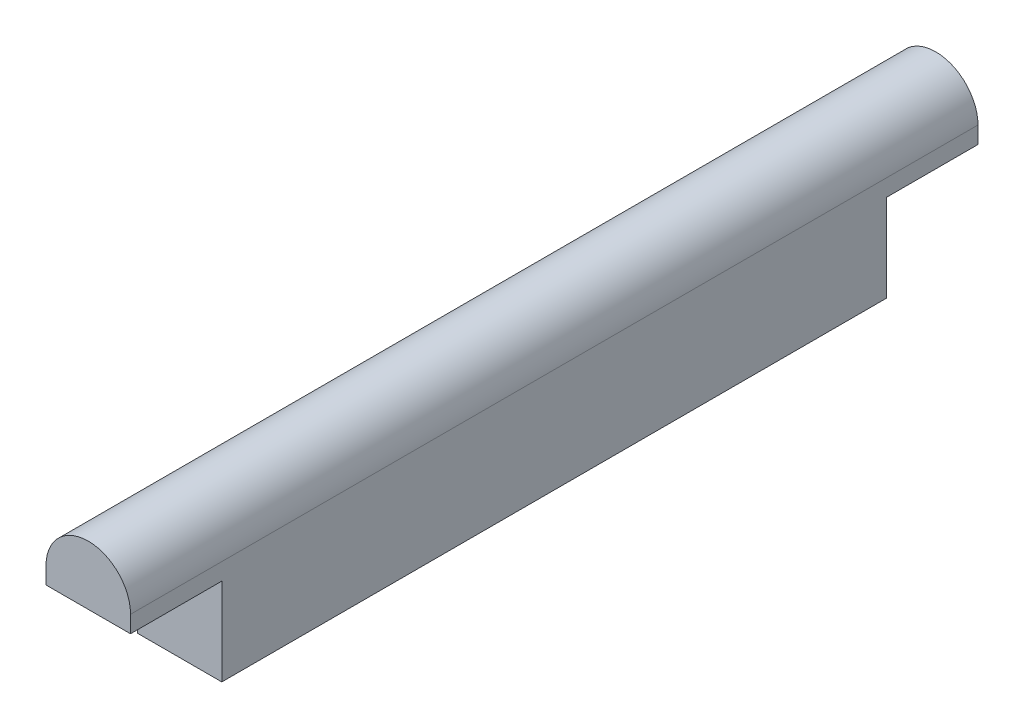
ISO-10303-21;
HEADER;
FILE_DESCRIPTION(('STEP AP214'),'2;1');
FILE_NAME('part.step','',(''),(''),'','','');
FILE_SCHEMA(('AUTOMOTIVE_DESIGN { 1 0 10303 214 1 1 1 1 }'));
ENDSEC;
DATA;
#1=APPLICATION_CONTEXT('core data for automotive mechanical design processes');
#2=APPLICATION_PROTOCOL_DEFINITION('international standard','automotive_design',2000,#1);
#3=PRODUCT_CONTEXT('',#1,'mechanical');
#4=PRODUCT('Part','Part','',(#3));
#5=PRODUCT_RELATED_PRODUCT_CATEGORY('part','',(#4));
#6=PRODUCT_DEFINITION_FORMATION('','',#4);
#7=PRODUCT_DEFINITION_CONTEXT('part definition',#1,'design');
#8=PRODUCT_DEFINITION('design','',#6,#7);
#9=PRODUCT_DEFINITION_SHAPE('','',#8);
#10=(LENGTH_UNIT() NAMED_UNIT(*) SI_UNIT(.MILLI.,.METRE.));
#11=(NAMED_UNIT(*) PLANE_ANGLE_UNIT() SI_UNIT($,.RADIAN.));
#12=(NAMED_UNIT(*) SI_UNIT($,.STERADIAN.) SOLID_ANGLE_UNIT());
#13=UNCERTAINTY_MEASURE_WITH_UNIT(LENGTH_MEASURE(1.E-05),#10,'distance_accuracy_value','');
#14=(GEOMETRIC_REPRESENTATION_CONTEXT(3) GLOBAL_UNCERTAINTY_ASSIGNED_CONTEXT((#13)) GLOBAL_UNIT_ASSIGNED_CONTEXT((#10,
#11,#12)) REPRESENTATION_CONTEXT('',''));
#15=CARTESIAN_POINT('',(0.,0.,0.));
#16=DIRECTION('',(0.,0.,1.));
#17=DIRECTION('',(1.,0.,0.));
#18=AXIS2_PLACEMENT_3D('',#15,#16,#17);
#19=CARTESIAN_POINT('',(7.5,-7.75,118.));
#20=DIRECTION('',(-1.,0.,0.));
#21=DIRECTION('',(0.,0.,1.));
#22=AXIS2_PLACEMENT_3D('',#19,#20,#21);
#23=PLANE('',#22);
#24=DIRECTION('',(0.,1.,0.));
#25=VECTOR('',#24,1.);
#26=CARTESIAN_POINT('',(7.5,-7.75,0.));
#27=LINE('',#26,#25);
#28=CARTESIAN_POINT('',(7.5,-7.75,0.));
#29=VERTEX_POINT('',#28);
#30=CARTESIAN_POINT('',(7.5,7.75,0.));
#31=VERTEX_POINT('',#30);
#32=EDGE_CURVE('E135',#29,#31,#27,.T.);
#33=ORIENTED_EDGE('',*,*,#32,.T.);
#34=DIRECTION('',(0.,0.,1.));
#35=VECTOR('',#34,1.);
#36=CARTESIAN_POINT('',(7.5,7.75,-16.2));
#37=LINE('',#36,#35);
#38=CARTESIAN_POINT('',(7.5,7.75,-16.2));
#39=VERTEX_POINT('',#38);
#40=EDGE_CURVE('E158',#39,#31,#37,.T.);
#41=ORIENTED_EDGE('',*,*,#40,.F.);
#42=DIRECTION('',(0.,1.,0.));
#43=VECTOR('',#42,1.);
#44=CARTESIAN_POINT('',(7.5,7.75,-16.2));
#45=LINE('',#44,#43);
#46=CARTESIAN_POINT('',(7.5,10.75,-16.2));
#47=VERTEX_POINT('',#46);
#48=EDGE_CURVE('E211',#39,#47,#45,.T.);
#49=ORIENTED_EDGE('',*,*,#48,.T.);
#50=DIRECTION('',(0.,0.,1.));
#51=VECTOR('',#50,1.);
#52=CARTESIAN_POINT('',(7.5,10.75,-16.2));
#53=LINE('',#52,#51);
#54=CARTESIAN_POINT('',(7.5,10.75,134.2));
#55=VERTEX_POINT('',#54);
#56=EDGE_CURVE('E188',#47,#55,#53,.T.);
#57=ORIENTED_EDGE('',*,*,#56,.T.);
#58=DIRECTION('',(0.,1.,0.));
#59=VECTOR('',#58,1.);
#60=CARTESIAN_POINT('',(7.5,7.75,134.2));
#61=LINE('',#60,#59);
#62=CARTESIAN_POINT('',(7.5,7.75,134.2));
#63=VERTEX_POINT('',#62);
#64=EDGE_CURVE('E195',#63,#55,#61,.T.);
#65=ORIENTED_EDGE('',*,*,#64,.F.);
#66=CARTESIAN_POINT('',(7.5,7.75,118.));
#67=VERTEX_POINT('',#66);
#68=EDGE_CURVE('E218',#67,#63,#37,.T.);
#69=ORIENTED_EDGE('',*,*,#68,.F.);
#70=DIRECTION('',(0.,1.,0.));
#71=VECTOR('',#70,1.);
#72=CARTESIAN_POINT('',(7.5,-7.75,118.));
#73=LINE('',#72,#71);
#74=CARTESIAN_POINT('',(7.5,-7.75,118.));
#75=VERTEX_POINT('',#74);
#76=EDGE_CURVE('E124',#75,#67,#73,.T.);
#77=ORIENTED_EDGE('',*,*,#76,.F.);
#78=DIRECTION('',(0.,0.,-1.));
#79=VECTOR('',#78,1.);
#80=CARTESIAN_POINT('',(7.5,-7.75,118.));
#81=LINE('',#80,#79);
#82=EDGE_CURVE('E67',#75,#29,#81,.T.);
#83=ORIENTED_EDGE('',*,*,#82,.T.);
#84=EDGE_LOOP('',(#33,#41,#49,#57,#65,#69,#77,#83));
#85=FACE_BOUND('',#84,.T.);
#86=ADVANCED_FACE('F58',(#85),#23,.F.);
#87=CARTESIAN_POINT('',(-7.5,-7.75,118.));
#88=DIRECTION('',(1.,0.,0.));
#89=DIRECTION('',(0.,0.,-1.));
#90=AXIS2_PLACEMENT_3D('',#87,#88,#89);
#91=PLANE('',#90);
#92=DIRECTION('',(0.,-1.,0.));
#93=VECTOR('',#92,1.);
#94=CARTESIAN_POINT('',(-7.5,-7.75,0.));
#95=LINE('',#94,#93);
#96=CARTESIAN_POINT('',(-7.5,7.75,0.));
#97=VERTEX_POINT('',#96);
#98=CARTESIAN_POINT('',(-7.5,-7.75,0.));
#99=VERTEX_POINT('',#98);
#100=EDGE_CURVE('E87',#97,#99,#95,.T.);
#101=ORIENTED_EDGE('',*,*,#100,.T.);
#102=DIRECTION('',(0.,0.,-1.));
#103=VECTOR('',#102,1.);
#104=CARTESIAN_POINT('',(-7.5,-7.75,118.));
#105=LINE('',#104,#103);
#106=CARTESIAN_POINT('',(-7.5,-7.75,118.));
#107=VERTEX_POINT('',#106);
#108=EDGE_CURVE('E13',#107,#99,#105,.T.);
#109=ORIENTED_EDGE('',*,*,#108,.F.);
#110=DIRECTION('',(0.,-1.,0.));
#111=VECTOR('',#110,1.);
#112=CARTESIAN_POINT('',(-7.5,-7.75,118.));
#113=LINE('',#112,#111);
#114=CARTESIAN_POINT('',(-7.5,7.75,118.));
#115=VERTEX_POINT('',#114);
#116=EDGE_CURVE('E122',#115,#107,#113,.T.);
#117=ORIENTED_EDGE('',*,*,#116,.F.);
#118=DIRECTION('',(0.,0.,1.));
#119=VECTOR('',#118,1.);
#120=CARTESIAN_POINT('',(-7.5,7.75,-16.2));
#121=LINE('',#120,#119);
#122=CARTESIAN_POINT('',(-7.5,7.75,134.2));
#123=VERTEX_POINT('',#122);
#124=EDGE_CURVE('E105',#115,#123,#121,.T.);
#125=ORIENTED_EDGE('',*,*,#124,.T.);
#126=DIRECTION('',(0.,1.,0.));
#127=VECTOR('',#126,1.);
#128=CARTESIAN_POINT('',(-7.5,7.75,134.2));
#129=LINE('',#128,#127);
#130=CARTESIAN_POINT('',(-7.5,10.75,134.2));
#131=VERTEX_POINT('',#130);
#132=EDGE_CURVE('E193',#123,#131,#129,.T.);
#133=ORIENTED_EDGE('',*,*,#132,.T.);
#134=DIRECTION('',(0.,0.,1.));
#135=VECTOR('',#134,1.);
#136=CARTESIAN_POINT('',(-7.5,10.75,-16.2));
#137=LINE('',#136,#135);
#138=CARTESIAN_POINT('',(-7.5,10.75,-16.2));
#139=VERTEX_POINT('',#138);
#140=EDGE_CURVE('E139',#139,#131,#137,.T.);
#141=ORIENTED_EDGE('',*,*,#140,.F.);
#142=DIRECTION('',(0.,1.,0.));
#143=VECTOR('',#142,1.);
#144=CARTESIAN_POINT('',(-7.5,7.75,-16.2));
#145=LINE('',#144,#143);
#146=CARTESIAN_POINT('',(-7.5,7.75,-16.2));
#147=VERTEX_POINT('',#146);
#148=EDGE_CURVE('E206',#147,#139,#145,.T.);
#149=ORIENTED_EDGE('',*,*,#148,.F.);
#150=EDGE_CURVE('E118',#147,#97,#121,.T.);
#151=ORIENTED_EDGE('',*,*,#150,.T.);
#152=EDGE_LOOP('',(#101,#109,#117,#125,#133,#141,#149,#151));
#153=FACE_BOUND('',#152,.T.);
#154=ADVANCED_FACE('F127',(#153),#91,.F.);
#155=CARTESIAN_POINT('',(-7.5,-7.75,118.));
#156=DIRECTION('',(0.,1.,0.));
#157=DIRECTION('',(0.,0.,1.));
#158=AXIS2_PLACEMENT_3D('',#155,#156,#157);
#159=PLANE('',#158);
#160=DIRECTION('',(1.,0.,0.));
#161=VECTOR('',#160,1.);
#162=CARTESIAN_POINT('',(-7.5,-7.75,0.));
#163=LINE('',#162,#161);
#164=EDGE_CURVE('E144',#99,#29,#163,.T.);
#165=ORIENTED_EDGE('',*,*,#164,.T.);
#166=ORIENTED_EDGE('',*,*,#82,.F.);
#167=DIRECTION('',(1.,0.,0.));
#168=VECTOR('',#167,1.);
#169=CARTESIAN_POINT('',(-7.5,-7.75,118.));
#170=LINE('',#169,#168);
#171=EDGE_CURVE('E75',#107,#75,#170,.T.);
#172=ORIENTED_EDGE('',*,*,#171,.F.);
#173=ORIENTED_EDGE('',*,*,#108,.T.);
#174=EDGE_LOOP('',(#165,#166,#172,#173));
#175=FACE_BOUND('',#174,.T.);
#176=ADVANCED_FACE('F281',(#175),#159,.F.);
#177=CARTESIAN_POINT('',(0.,0.,118.));
#178=DIRECTION('',(0.,0.,-1.));
#179=DIRECTION('',(-1.,0.,0.));
#180=AXIS2_PLACEMENT_3D('',#177,#178,#179);
#181=PLANE('',#180);
#182=ORIENTED_EDGE('',*,*,#76,.T.);
#183=DIRECTION('',(-1.,0.,0.));
#184=VECTOR('',#183,1.);
#185=CARTESIAN_POINT('',(-7.5,7.75,118.));
#186=LINE('',#185,#184);
#187=EDGE_CURVE('E109',#67,#115,#186,.T.);
#188=ORIENTED_EDGE('',*,*,#187,.T.);
#189=ORIENTED_EDGE('',*,*,#116,.T.);
#190=ORIENTED_EDGE('',*,*,#171,.T.);
#191=EDGE_LOOP('',(#182,#188,#189,#190));
#192=FACE_BOUND('',#191,.T.);
#193=ADVANCED_FACE('F121',(#192),#181,.F.);
#194=CARTESIAN_POINT('',(0.,0.,0.));
#195=DIRECTION('',(0.,0.,-1.));
#196=DIRECTION('',(-1.,0.,0.));
#197=AXIS2_PLACEMENT_3D('',#194,#195,#196);
#198=PLANE('',#197);
#199=ORIENTED_EDGE('',*,*,#32,.F.);
#200=ORIENTED_EDGE('',*,*,#164,.F.);
#201=ORIENTED_EDGE('',*,*,#100,.F.);
#202=DIRECTION('',(-1.,0.,0.));
#203=VECTOR('',#202,1.);
#204=CARTESIAN_POINT('',(-7.5,7.75,0.));
#205=LINE('',#204,#203);
#206=EDGE_CURVE('E96',#31,#97,#205,.T.);
#207=ORIENTED_EDGE('',*,*,#206,.F.);
#208=EDGE_LOOP('',(#199,#200,#201,#207));
#209=FACE_BOUND('',#208,.T.);
#210=ADVANCED_FACE('F155',(#209),#198,.T.);
#211=CARTESIAN_POINT('',(-7.5,7.75,-16.2));
#212=DIRECTION('',(0.,-1.,0.));
#213=DIRECTION('',(1.,0.,0.));
#214=AXIS2_PLACEMENT_3D('',#211,#212,#213);
#215=PLANE('',#214);
#216=ORIENTED_EDGE('',*,*,#187,.F.);
#217=ORIENTED_EDGE('',*,*,#68,.T.);
#218=DIRECTION('',(1.,0.,0.));
#219=VECTOR('',#218,1.);
#220=CARTESIAN_POINT('',(-7.5,7.75,134.2));
#221=LINE('',#220,#219);
#222=EDGE_CURVE('E113',#123,#63,#221,.T.);
#223=ORIENTED_EDGE('',*,*,#222,.F.);
#224=ORIENTED_EDGE('',*,*,#124,.F.);
#225=EDGE_LOOP('',(#216,#217,#223,#224));
#226=FACE_BOUND('',#225,.T.);
#227=ADVANCED_FACE('F107',(#226),#215,.T.);
#228=CARTESIAN_POINT('',(0.,10.75,-16.2));
#229=DIRECTION('',(0.,0.,1.));
#230=DIRECTION('',(1.,0.,0.));
#231=AXIS2_PLACEMENT_3D('',#228,#229,#230);
#232=CYLINDRICAL_SURFACE('',#231,7.5);
#233=ORIENTED_EDGE('',*,*,#140,.T.);
#234=CARTESIAN_POINT('',(0.,10.75,134.2));
#235=DIRECTION('',(0.,0.,-1.));
#236=DIRECTION('',(-1.,0.,0.));
#237=AXIS2_PLACEMENT_3D('',#234,#235,#236);
#238=CIRCLE('',#237,7.5);
#239=EDGE_CURVE('E183',#131,#55,#238,.T.);
#240=ORIENTED_EDGE('',*,*,#239,.T.);
#241=ORIENTED_EDGE('',*,*,#56,.F.);
#242=CARTESIAN_POINT('',(0.,10.75,-16.2));
#243=DIRECTION('',(0.,0.,-1.));
#244=DIRECTION('',(-1.,0.,0.));
#245=AXIS2_PLACEMENT_3D('',#242,#243,#244);
#246=CIRCLE('',#245,7.5);
#247=EDGE_CURVE('E184',#139,#47,#246,.T.);
#248=ORIENTED_EDGE('',*,*,#247,.F.);
#249=EDGE_LOOP('',(#233,#240,#241,#248));
#250=FACE_BOUND('',#249,.T.);
#251=ADVANCED_FACE('F181',(#250),#232,.T.);
#252=ORIENTED_EDGE('',*,*,#40,.T.);
#253=ORIENTED_EDGE('',*,*,#206,.T.);
#254=ORIENTED_EDGE('',*,*,#150,.F.);
#255=DIRECTION('',(1.,0.,0.));
#256=VECTOR('',#255,1.);
#257=CARTESIAN_POINT('',(-7.5,7.75,-16.2));
#258=LINE('',#257,#256);
#259=EDGE_CURVE('E119',#147,#39,#258,.T.);
#260=ORIENTED_EDGE('',*,*,#259,.T.);
#261=EDGE_LOOP('',(#252,#253,#254,#260));
#262=FACE_BOUND('',#261,.T.);
#263=ADVANCED_FACE('F266',(#262),#215,.T.);
#264=CARTESIAN_POINT('',(0.,10.75,-16.2));
#265=DIRECTION('',(0.,0.,-1.));
#266=DIRECTION('',(-1.,0.,0.));
#267=AXIS2_PLACEMENT_3D('',#264,#265,#266);
#268=PLANE('',#267);
#269=ORIENTED_EDGE('',*,*,#148,.T.);
#270=ORIENTED_EDGE('',*,*,#247,.T.);
#271=ORIENTED_EDGE('',*,*,#48,.F.);
#272=ORIENTED_EDGE('',*,*,#259,.F.);
#273=EDGE_LOOP('',(#269,#270,#271,#272));
#274=FACE_BOUND('',#273,.T.);
#275=ADVANCED_FACE('F265',(#274),#268,.T.);
#276=CARTESIAN_POINT('',(0.,10.75,134.2));
#277=DIRECTION('',(0.,0.,-1.));
#278=DIRECTION('',(-1.,0.,0.));
#279=AXIS2_PLACEMENT_3D('',#276,#277,#278);
#280=PLANE('',#279);
#281=ORIENTED_EDGE('',*,*,#132,.F.);
#282=ORIENTED_EDGE('',*,*,#222,.T.);
#283=ORIENTED_EDGE('',*,*,#64,.T.);
#284=ORIENTED_EDGE('',*,*,#239,.F.);
#285=EDGE_LOOP('',(#281,#282,#283,#284));
#286=FACE_BOUND('',#285,.T.);
#287=ADVANCED_FACE('F192',(#286),#280,.F.);
#288=CLOSED_SHELL('',(#86,#154,#176,#193,#210,#227,#251,#263,#275,#287));
#289=MANIFOLD_SOLID_BREP('B2',#288);
#290=ADVANCED_BREP_SHAPE_REPRESENTATION('',(#18,#289),#14);
#291=SHAPE_DEFINITION_REPRESENTATION(#9,#290);
ENDSEC;
END-ISO-10303-21;
